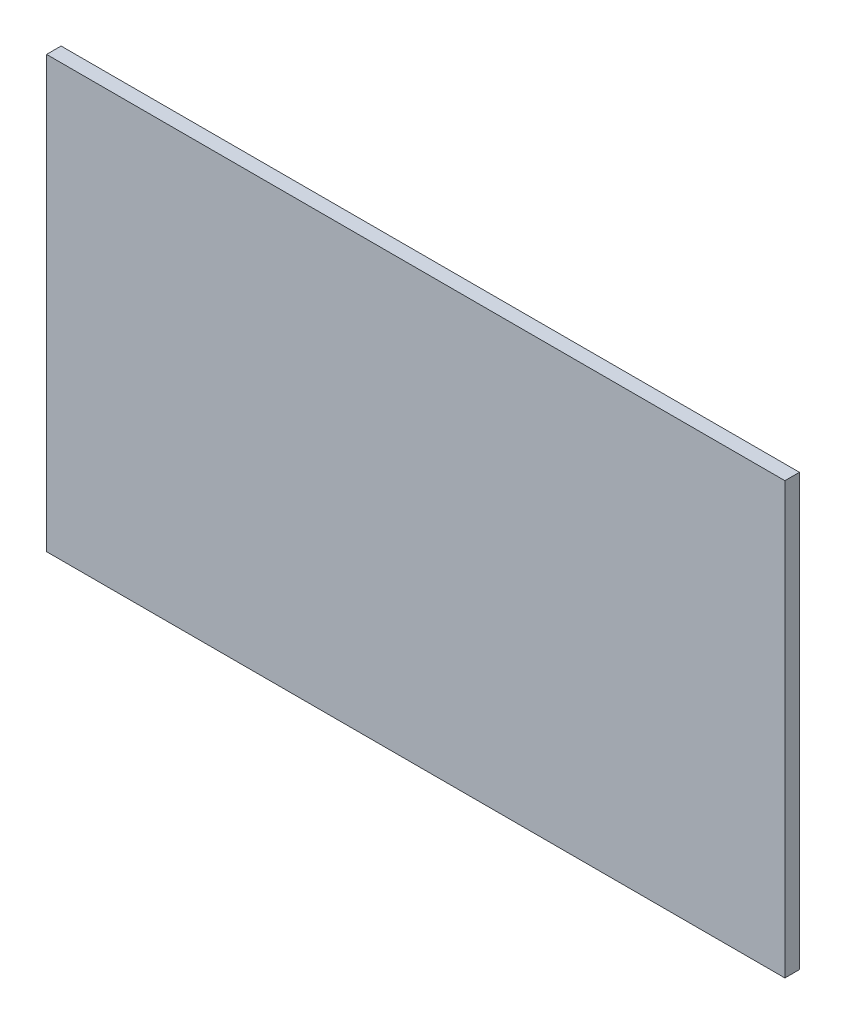
ISO-10303-21;
HEADER;
FILE_DESCRIPTION(('STEP AP214'),'2;1');
FILE_NAME('part.step','',(''),(''),'','','');
FILE_SCHEMA(('AUTOMOTIVE_DESIGN { 1 0 10303 214 1 1 1 1 }'));
ENDSEC;
DATA;
#1=APPLICATION_CONTEXT('core data for automotive mechanical design processes');
#2=APPLICATION_PROTOCOL_DEFINITION('international standard','automotive_design',2000,#1);
#3=PRODUCT_CONTEXT('',#1,'mechanical');
#4=PRODUCT('Part','Part','',(#3));
#5=PRODUCT_RELATED_PRODUCT_CATEGORY('part','',(#4));
#6=PRODUCT_DEFINITION_FORMATION('','',#4);
#7=PRODUCT_DEFINITION_CONTEXT('part definition',#1,'design');
#8=PRODUCT_DEFINITION('design','',#6,#7);
#9=PRODUCT_DEFINITION_SHAPE('','',#8);
#10=(LENGTH_UNIT() NAMED_UNIT(*) SI_UNIT(.MILLI.,.METRE.));
#11=(NAMED_UNIT(*) PLANE_ANGLE_UNIT() SI_UNIT($,.RADIAN.));
#12=(NAMED_UNIT(*) SI_UNIT($,.STERADIAN.) SOLID_ANGLE_UNIT());
#13=UNCERTAINTY_MEASURE_WITH_UNIT(LENGTH_MEASURE(1.E-05),#10,'distance_accuracy_value','');
#14=(GEOMETRIC_REPRESENTATION_CONTEXT(3) GLOBAL_UNCERTAINTY_ASSIGNED_CONTEXT((#13)) GLOBAL_UNIT_ASSIGNED_CONTEXT((#10,
#11,#12)) REPRESENTATION_CONTEXT('',''));
#15=CARTESIAN_POINT('',(0.,0.,0.));
#16=DIRECTION('',(0.,0.,1.));
#17=DIRECTION('',(1.,0.,0.));
#18=AXIS2_PLACEMENT_3D('',#15,#16,#17);
#19=CARTESIAN_POINT('',(0.,0.,2.9972));
#20=DIRECTION('',(1.,0.,0.));
#21=DIRECTION('',(0.,1.,0.));
#22=AXIS2_PLACEMENT_3D('',#19,#20,#21);
#23=PLANE('',#22);
#24=DIRECTION('',(0.,-1.,0.));
#25=VECTOR('',#24,1.);
#26=CARTESIAN_POINT('',(0.,0.,0.));
#27=LINE('',#26,#25);
#28=CARTESIAN_POINT('',(0.,0.,0.));
#29=VERTEX_POINT('',#28);
#30=CARTESIAN_POINT('',(0.,-88.9,0.));
#31=VERTEX_POINT('',#30);
#32=EDGE_CURVE('E96',#29,#31,#27,.T.);
#33=ORIENTED_EDGE('',*,*,#32,.T.);
#34=DIRECTION('',(0.,0.,-1.));
#35=VECTOR('',#34,1.);
#36=CARTESIAN_POINT('',(0.,-88.9,2.9972));
#37=LINE('',#36,#35);
#38=CARTESIAN_POINT('',(0.,-88.9,2.9972));
#39=VERTEX_POINT('',#38);
#40=EDGE_CURVE('E11',#39,#31,#37,.T.);
#41=ORIENTED_EDGE('',*,*,#40,.F.);
#42=DIRECTION('',(0.,-1.,0.));
#43=VECTOR('',#42,1.);
#44=CARTESIAN_POINT('',(0.,0.,2.9972));
#45=LINE('',#44,#43);
#46=CARTESIAN_POINT('',(0.,0.,2.9972));
#47=VERTEX_POINT('',#46);
#48=EDGE_CURVE('E84',#47,#39,#45,.T.);
#49=ORIENTED_EDGE('',*,*,#48,.F.);
#50=DIRECTION('',(0.,0.,-1.));
#51=VECTOR('',#50,1.);
#52=CARTESIAN_POINT('',(0.,0.,2.9972));
#53=LINE('',#52,#51);
#54=EDGE_CURVE('E92',#47,#29,#53,.T.);
#55=ORIENTED_EDGE('',*,*,#54,.T.);
#56=EDGE_LOOP('',(#33,#41,#49,#55));
#57=FACE_BOUND('',#56,.T.);
#58=ADVANCED_FACE('F33',(#57),#23,.F.);
#59=CARTESIAN_POINT('',(0.,-88.9,2.9972));
#60=DIRECTION('',(0.,1.,0.));
#61=DIRECTION('',(0.,0.,1.));
#62=AXIS2_PLACEMENT_3D('',#59,#60,#61);
#63=PLANE('',#62);
#64=DIRECTION('',(1.,0.,0.));
#65=VECTOR('',#64,1.);
#66=CARTESIAN_POINT('',(0.,-88.9,0.));
#67=LINE('',#66,#65);
#68=CARTESIAN_POINT('',(152.4,-88.9,0.));
#69=VERTEX_POINT('',#68);
#70=EDGE_CURVE('E88',#31,#69,#67,.T.);
#71=ORIENTED_EDGE('',*,*,#70,.T.);
#72=DIRECTION('',(0.,0.,-1.));
#73=VECTOR('',#72,1.);
#74=CARTESIAN_POINT('',(152.4,-88.9,2.9972));
#75=LINE('',#74,#73);
#76=CARTESIAN_POINT('',(152.4,-88.9,2.9972));
#77=VERTEX_POINT('',#76);
#78=EDGE_CURVE('E41',#77,#69,#75,.T.);
#79=ORIENTED_EDGE('',*,*,#78,.F.);
#80=DIRECTION('',(1.,0.,0.));
#81=VECTOR('',#80,1.);
#82=CARTESIAN_POINT('',(0.,-88.9,2.9972));
#83=LINE('',#82,#81);
#84=EDGE_CURVE('E79',#39,#77,#83,.T.);
#85=ORIENTED_EDGE('',*,*,#84,.F.);
#86=ORIENTED_EDGE('',*,*,#40,.T.);
#87=EDGE_LOOP('',(#71,#79,#85,#86));
#88=FACE_BOUND('',#87,.T.);
#89=ADVANCED_FACE('F87',(#88),#63,.F.);
#90=CARTESIAN_POINT('',(152.4,0.,2.9972));
#91=DIRECTION('',(-1.,0.,0.));
#92=DIRECTION('',(0.,0.,1.));
#93=AXIS2_PLACEMENT_3D('',#90,#91,#92);
#94=PLANE('',#93);
#95=DIRECTION('',(0.,1.,0.));
#96=VECTOR('',#95,1.);
#97=CARTESIAN_POINT('',(152.4,0.,0.));
#98=LINE('',#97,#96);
#99=CARTESIAN_POINT('',(152.4,0.,0.));
#100=VERTEX_POINT('',#99);
#101=EDGE_CURVE('E66',#69,#100,#98,.T.);
#102=ORIENTED_EDGE('',*,*,#101,.T.);
#103=DIRECTION('',(0.,0.,-1.));
#104=VECTOR('',#103,1.);
#105=CARTESIAN_POINT('',(152.4,0.,2.9972));
#106=LINE('',#105,#104);
#107=CARTESIAN_POINT('',(152.4,0.,2.9972));
#108=VERTEX_POINT('',#107);
#109=EDGE_CURVE('E89',#108,#100,#106,.T.);
#110=ORIENTED_EDGE('',*,*,#109,.F.);
#111=DIRECTION('',(0.,1.,0.));
#112=VECTOR('',#111,1.);
#113=CARTESIAN_POINT('',(152.4,0.,2.9972));
#114=LINE('',#113,#112);
#115=EDGE_CURVE('E82',#77,#108,#114,.T.);
#116=ORIENTED_EDGE('',*,*,#115,.F.);
#117=ORIENTED_EDGE('',*,*,#78,.T.);
#118=EDGE_LOOP('',(#102,#110,#116,#117));
#119=FACE_BOUND('',#118,.T.);
#120=ADVANCED_FACE('F90',(#119),#94,.F.);
#121=CARTESIAN_POINT('',(0.,0.,2.9972));
#122=DIRECTION('',(0.,-1.,0.));
#123=DIRECTION('',(0.,0.,-1.));
#124=AXIS2_PLACEMENT_3D('',#121,#122,#123);
#125=PLANE('',#124);
#126=DIRECTION('',(-1.,0.,0.));
#127=VECTOR('',#126,1.);
#128=CARTESIAN_POINT('',(0.,0.,0.));
#129=LINE('',#128,#127);
#130=EDGE_CURVE('E72',#100,#29,#129,.T.);
#131=ORIENTED_EDGE('',*,*,#130,.T.);
#132=ORIENTED_EDGE('',*,*,#54,.F.);
#133=DIRECTION('',(-1.,0.,0.));
#134=VECTOR('',#133,1.);
#135=CARTESIAN_POINT('',(0.,0.,2.9972));
#136=LINE('',#135,#134);
#137=EDGE_CURVE('E49',#108,#47,#136,.T.);
#138=ORIENTED_EDGE('',*,*,#137,.F.);
#139=ORIENTED_EDGE('',*,*,#109,.T.);
#140=EDGE_LOOP('',(#131,#132,#138,#139));
#141=FACE_BOUND('',#140,.T.);
#142=ADVANCED_FACE('F103',(#141),#125,.F.);
#143=CARTESIAN_POINT('',(0.,0.,2.9972));
#144=DIRECTION('',(0.,0.,1.));
#145=DIRECTION('',(1.,0.,0.));
#146=AXIS2_PLACEMENT_3D('',#143,#144,#145);
#147=PLANE('',#146);
#148=ORIENTED_EDGE('',*,*,#48,.T.);
#149=ORIENTED_EDGE('',*,*,#84,.T.);
#150=ORIENTED_EDGE('',*,*,#115,.T.);
#151=ORIENTED_EDGE('',*,*,#137,.T.);
#152=EDGE_LOOP('',(#148,#149,#150,#151));
#153=FACE_BOUND('',#152,.T.);
#154=ADVANCED_FACE('F80',(#153),#147,.T.);
#155=CARTESIAN_POINT('',(0.,0.,0.));
#156=DIRECTION('',(0.,0.,1.));
#157=DIRECTION('',(1.,0.,0.));
#158=AXIS2_PLACEMENT_3D('',#155,#156,#157);
#159=PLANE('',#158);
#160=ORIENTED_EDGE('',*,*,#32,.F.);
#161=ORIENTED_EDGE('',*,*,#130,.F.);
#162=ORIENTED_EDGE('',*,*,#101,.F.);
#163=ORIENTED_EDGE('',*,*,#70,.F.);
#164=EDGE_LOOP('',(#160,#161,#162,#163));
#165=FACE_BOUND('',#164,.T.);
#166=ADVANCED_FACE('F106',(#165),#159,.F.);
#167=CLOSED_SHELL('',(#58,#89,#120,#142,#154,#166));
#168=MANIFOLD_SOLID_BREP('B2',#167);
#169=ADVANCED_BREP_SHAPE_REPRESENTATION('',(#18,#168),#14);
#170=SHAPE_DEFINITION_REPRESENTATION(#9,#169);
ENDSEC;
END-ISO-10303-21;
